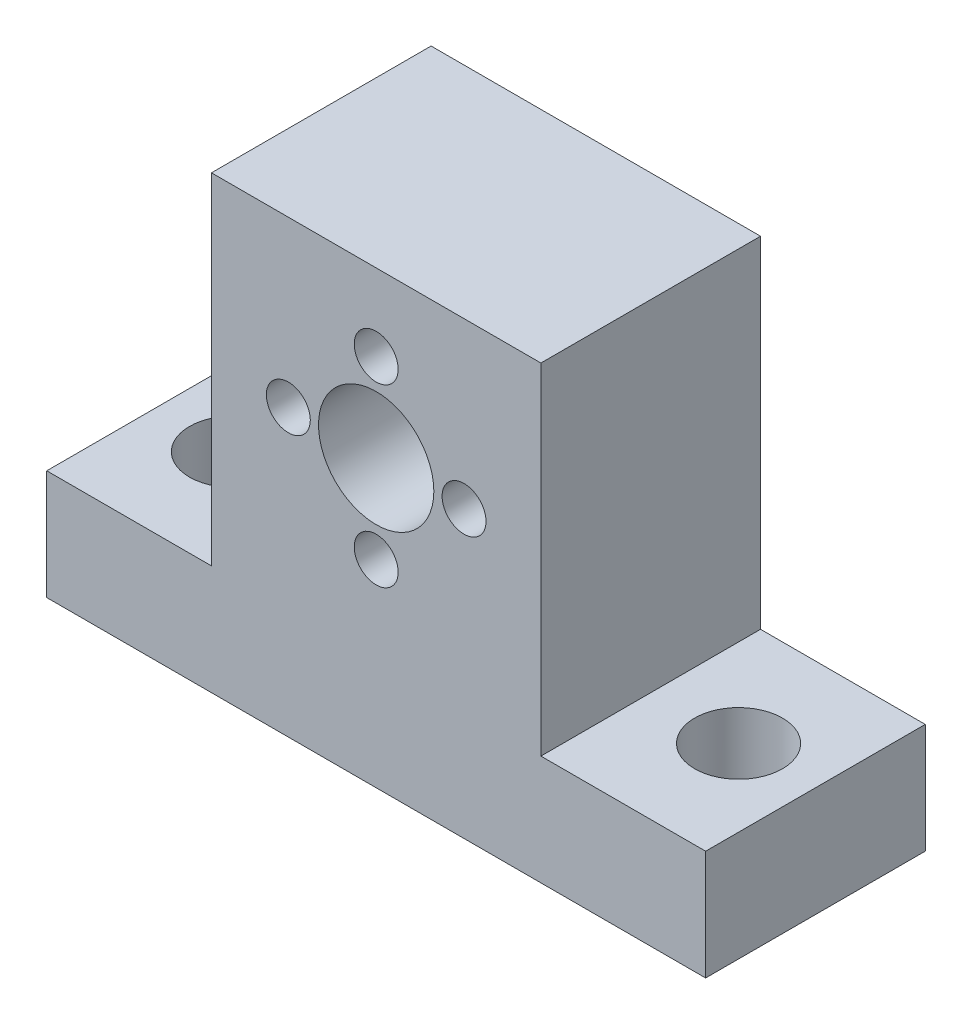
ISO-10303-21;
HEADER;
FILE_DESCRIPTION(('STEP AP214'),'2;1');
FILE_NAME('part.step','',(''),(''),'','','');
FILE_SCHEMA(('AUTOMOTIVE_DESIGN { 1 0 10303 214 1 1 1 1 }'));
ENDSEC;
DATA;
#1=APPLICATION_CONTEXT('core data for automotive mechanical design processes');
#2=APPLICATION_PROTOCOL_DEFINITION('international standard','automotive_design',2000,#1);
#3=PRODUCT_CONTEXT('',#1,'mechanical');
#4=PRODUCT('Part','Part','',(#3));
#5=PRODUCT_RELATED_PRODUCT_CATEGORY('part','',(#4));
#6=PRODUCT_DEFINITION_FORMATION('','',#4);
#7=PRODUCT_DEFINITION_CONTEXT('part definition',#1,'design');
#8=PRODUCT_DEFINITION('design','',#6,#7);
#9=PRODUCT_DEFINITION_SHAPE('','',#8);
#10=(LENGTH_UNIT() NAMED_UNIT(*) SI_UNIT(.MILLI.,.METRE.));
#11=(NAMED_UNIT(*) PLANE_ANGLE_UNIT() SI_UNIT($,.RADIAN.));
#12=(NAMED_UNIT(*) SI_UNIT($,.STERADIAN.) SOLID_ANGLE_UNIT());
#13=UNCERTAINTY_MEASURE_WITH_UNIT(LENGTH_MEASURE(1.E-05),#10,'distance_accuracy_value','');
#14=(GEOMETRIC_REPRESENTATION_CONTEXT(3) GLOBAL_UNCERTAINTY_ASSIGNED_CONTEXT((#13)) GLOBAL_UNIT_ASSIGNED_CONTEXT((#10,
#11,#12)) REPRESENTATION_CONTEXT('',''));
#15=CARTESIAN_POINT('',(0.,0.,0.));
#16=DIRECTION('',(0.,0.,1.));
#17=DIRECTION('',(1.,0.,0.));
#18=AXIS2_PLACEMENT_3D('',#15,#16,#17);
#19=CARTESIAN_POINT('',(0.,0.,20.));
#20=DIRECTION('',(0.,0.,-1.));
#21=DIRECTION('',(-1.,0.,0.));
#22=AXIS2_PLACEMENT_3D('',#19,#20,#21);
#23=PLANE('',#22);
#24=CARTESIAN_POINT('',(-8.,0.,20.));
#25=DIRECTION('',(0.,0.,1.));
#26=DIRECTION('',(1.,0.,0.));
#27=AXIS2_PLACEMENT_3D('',#24,#25,#26);
#28=CIRCLE('',#27,2.);
#29=CARTESIAN_POINT('',(-6.,0.,20.));
#30=VERTEX_POINT('',#29);
#31=EDGE_CURVE('E173',#30,#30,#28,.T.);
#32=ORIENTED_EDGE('',*,*,#31,.F.);
#33=EDGE_LOOP('',(#32));
#34=FACE_BOUND('',#33,.T.);
#35=CARTESIAN_POINT('',(0.,-8.,20.));
#36=DIRECTION('',(0.,0.,1.));
#37=DIRECTION('',(1.,0.,0.));
#38=AXIS2_PLACEMENT_3D('',#35,#36,#37);
#39=CIRCLE('',#38,2.);
#40=CARTESIAN_POINT('',(1.99999999999994,-8.,20.));
#41=VERTEX_POINT('',#40);
#42=EDGE_CURVE('E179',#41,#41,#39,.T.);
#43=ORIENTED_EDGE('',*,*,#42,.F.);
#44=EDGE_LOOP('',(#43));
#45=FACE_BOUND('',#44,.T.);
#46=CARTESIAN_POINT('',(8.,0.,20.));
#47=DIRECTION('',(0.,0.,1.));
#48=DIRECTION('',(1.,0.,0.));
#49=AXIS2_PLACEMENT_3D('',#46,#47,#48);
#50=CIRCLE('',#49,2.);
#51=CARTESIAN_POINT('',(10.,0.,20.));
#52=VERTEX_POINT('',#51);
#53=EDGE_CURVE('E185',#52,#52,#50,.T.);
#54=ORIENTED_EDGE('',*,*,#53,.F.);
#55=EDGE_LOOP('',(#54));
#56=FACE_BOUND('',#55,.T.);
#57=CARTESIAN_POINT('',(0.,8.,20.));
#58=DIRECTION('',(0.,0.,1.));
#59=DIRECTION('',(1.,0.,0.));
#60=AXIS2_PLACEMENT_3D('',#57,#58,#59);
#61=CIRCLE('',#60,2.);
#62=CARTESIAN_POINT('',(2.,8.,20.));
#63=VERTEX_POINT('',#62);
#64=EDGE_CURVE('E191',#63,#63,#61,.T.);
#65=ORIENTED_EDGE('',*,*,#64,.F.);
#66=EDGE_LOOP('',(#65));
#67=FACE_BOUND('',#66,.T.);
#68=CARTESIAN_POINT('',(0.,0.,20.));
#69=DIRECTION('',(0.,0.,1.));
#70=DIRECTION('',(1.,0.,0.));
#71=AXIS2_PLACEMENT_3D('',#68,#69,#70);
#72=CIRCLE('',#71,5.25);
#73=CARTESIAN_POINT('',(5.25,0.,20.));
#74=VERTEX_POINT('',#73);
#75=EDGE_CURVE('E132',#74,#74,#72,.T.);
#76=ORIENTED_EDGE('',*,*,#75,.F.);
#77=EDGE_LOOP('',(#76));
#78=FACE_BOUND('',#77,.T.);
#79=DIRECTION('',(1.,0.,0.));
#80=VECTOR('',#79,1.);
#81=CARTESIAN_POINT('',(0.,-16.,20.));
#82=LINE('',#81,#80);
#83=CARTESIAN_POINT('',(-29.9999999999634,-16.,20.));
#84=VERTEX_POINT('',#83);
#85=CARTESIAN_POINT('',(-15.,-16.,20.));
#86=VERTEX_POINT('',#85);
#87=EDGE_CURVE('E103',#84,#86,#82,.T.);
#88=ORIENTED_EDGE('',*,*,#87,.F.);
#89=DIRECTION('',(0.,-1.,0.));
#90=VECTOR('',#89,1.);
#91=CARTESIAN_POINT('',(-29.9999999999634,-26.,20.));
#92=LINE('',#91,#90);
#93=CARTESIAN_POINT('',(-29.9999999999634,-26.,20.));
#94=VERTEX_POINT('',#93);
#95=EDGE_CURVE('E113',#84,#94,#92,.T.);
#96=ORIENTED_EDGE('',*,*,#95,.T.);
#97=DIRECTION('',(1.,0.,0.));
#98=VECTOR('',#97,1.);
#99=CARTESIAN_POINT('',(-29.9999999999634,-26.,20.));
#100=LINE('',#99,#98);
#101=CARTESIAN_POINT('',(30.0000000000366,-26.,20.));
#102=VERTEX_POINT('',#101);
#103=EDGE_CURVE('E120',#94,#102,#100,.T.);
#104=ORIENTED_EDGE('',*,*,#103,.T.);
#105=DIRECTION('',(0.,1.,0.));
#106=VECTOR('',#105,1.);
#107=CARTESIAN_POINT('',(30.0000000000366,-26.,20.));
#108=LINE('',#107,#106);
#109=CARTESIAN_POINT('',(30.0000000000366,-16.,20.));
#110=VERTEX_POINT('',#109);
#111=EDGE_CURVE('E124',#102,#110,#108,.T.);
#112=ORIENTED_EDGE('',*,*,#111,.T.);
#113=DIRECTION('',(-1.,0.,0.));
#114=VECTOR('',#113,1.);
#115=CARTESIAN_POINT('',(0.,-16.,20.));
#116=LINE('',#115,#114);
#117=CARTESIAN_POINT('',(15.,-16.,20.));
#118=VERTEX_POINT('',#117);
#119=EDGE_CURVE('E151',#110,#118,#116,.T.);
#120=ORIENTED_EDGE('',*,*,#119,.T.);
#121=DIRECTION('',(0.,1.,0.));
#122=VECTOR('',#121,1.);
#123=CARTESIAN_POINT('',(15.,0.,20.));
#124=LINE('',#123,#122);
#125=CARTESIAN_POINT('',(15.,15.,20.));
#126=VERTEX_POINT('',#125);
#127=EDGE_CURVE('E154',#118,#126,#124,.T.);
#128=ORIENTED_EDGE('',*,*,#127,.T.);
#129=DIRECTION('',(-1.,0.,0.));
#130=VECTOR('',#129,1.);
#131=CARTESIAN_POINT('',(-29.9999999999634,15.,20.));
#132=LINE('',#131,#130);
#133=CARTESIAN_POINT('',(-15.,15.,20.));
#134=VERTEX_POINT('',#133);
#135=EDGE_CURVE('E121',#126,#134,#132,.T.);
#136=ORIENTED_EDGE('',*,*,#135,.T.);
#137=DIRECTION('',(0.,1.,0.));
#138=VECTOR('',#137,1.);
#139=CARTESIAN_POINT('',(-15.,0.,20.));
#140=LINE('',#139,#138);
#141=EDGE_CURVE('E109',#86,#134,#140,.T.);
#142=ORIENTED_EDGE('',*,*,#141,.F.);
#143=EDGE_LOOP('',(#88,#96,#104,#112,#120,#128,#136,#142));
#144=FACE_BOUND('',#143,.T.);
#145=ADVANCED_FACE('F34',(#34,#45,#56,#67,#78,#144),#23,.F.);
#146=CARTESIAN_POINT('',(0.,0.,0.));
#147=DIRECTION('',(0.,0.,-1.));
#148=DIRECTION('',(-1.,0.,0.));
#149=AXIS2_PLACEMENT_3D('',#146,#147,#148);
#150=PLANE('',#149);
#151=CARTESIAN_POINT('',(0.,-8.,0.));
#152=DIRECTION('',(0.,0.,1.));
#153=DIRECTION('',(1.,0.,0.));
#154=AXIS2_PLACEMENT_3D('',#151,#152,#153);
#155=CIRCLE('',#154,2.);
#156=CARTESIAN_POINT('',(1.99999999999994,-8.,0.));
#157=VERTEX_POINT('',#156);
#158=EDGE_CURVE('E176',#157,#157,#155,.T.);
#159=ORIENTED_EDGE('',*,*,#158,.T.);
#160=EDGE_LOOP('',(#159));
#161=FACE_BOUND('',#160,.T.);
#162=CARTESIAN_POINT('',(0.,8.,0.));
#163=DIRECTION('',(0.,0.,1.));
#164=DIRECTION('',(1.,0.,0.));
#165=AXIS2_PLACEMENT_3D('',#162,#163,#164);
#166=CIRCLE('',#165,2.);
#167=CARTESIAN_POINT('',(2.,8.,0.));
#168=VERTEX_POINT('',#167);
#169=EDGE_CURVE('E188',#168,#168,#166,.T.);
#170=ORIENTED_EDGE('',*,*,#169,.T.);
#171=EDGE_LOOP('',(#170));
#172=FACE_BOUND('',#171,.T.);
#173=CARTESIAN_POINT('',(0.,0.,0.));
#174=DIRECTION('',(0.,0.,1.));
#175=DIRECTION('',(1.,0.,0.));
#176=AXIS2_PLACEMENT_3D('',#173,#174,#175);
#177=CIRCLE('',#176,5.25);
#178=CARTESIAN_POINT('',(5.25,0.,0.));
#179=VERTEX_POINT('',#178);
#180=EDGE_CURVE('E194',#179,#179,#177,.T.);
#181=ORIENTED_EDGE('',*,*,#180,.T.);
#182=EDGE_LOOP('',(#181));
#183=FACE_BOUND('',#182,.T.);
#184=CARTESIAN_POINT('',(8.,0.,0.));
#185=DIRECTION('',(0.,0.,1.));
#186=DIRECTION('',(1.,0.,0.));
#187=AXIS2_PLACEMENT_3D('',#184,#185,#186);
#188=CIRCLE('',#187,2.);
#189=CARTESIAN_POINT('',(10.,0.,0.));
#190=VERTEX_POINT('',#189);
#191=EDGE_CURVE('E182',#190,#190,#188,.T.);
#192=ORIENTED_EDGE('',*,*,#191,.T.);
#193=EDGE_LOOP('',(#192));
#194=FACE_BOUND('',#193,.T.);
#195=CARTESIAN_POINT('',(-8.,0.,0.));
#196=DIRECTION('',(0.,0.,1.));
#197=DIRECTION('',(1.,0.,0.));
#198=AXIS2_PLACEMENT_3D('',#195,#196,#197);
#199=CIRCLE('',#198,2.);
#200=CARTESIAN_POINT('',(-6.,0.,0.));
#201=VERTEX_POINT('',#200);
#202=EDGE_CURVE('E170',#201,#201,#199,.T.);
#203=ORIENTED_EDGE('',*,*,#202,.T.);
#204=EDGE_LOOP('',(#203));
#205=FACE_BOUND('',#204,.T.);
#206=DIRECTION('',(0.,-1.,0.));
#207=VECTOR('',#206,1.);
#208=CARTESIAN_POINT('',(-29.9999999999634,-26.,0.));
#209=LINE('',#208,#207);
#210=CARTESIAN_POINT('',(-29.9999999999634,-16.,0.));
#211=VERTEX_POINT('',#210);
#212=CARTESIAN_POINT('',(-29.9999999999634,-26.,0.));
#213=VERTEX_POINT('',#212);
#214=EDGE_CURVE('E135',#211,#213,#209,.T.);
#215=ORIENTED_EDGE('',*,*,#214,.F.);
#216=DIRECTION('',(1.,0.,0.));
#217=VECTOR('',#216,1.);
#218=CARTESIAN_POINT('',(0.,-16.,0.));
#219=LINE('',#218,#217);
#220=CARTESIAN_POINT('',(-15.,-16.,0.));
#221=VERTEX_POINT('',#220);
#222=EDGE_CURVE('E59',#211,#221,#219,.T.);
#223=ORIENTED_EDGE('',*,*,#222,.T.);
#224=DIRECTION('',(0.,1.,0.));
#225=VECTOR('',#224,1.);
#226=CARTESIAN_POINT('',(-15.,0.,0.));
#227=LINE('',#226,#225);
#228=CARTESIAN_POINT('',(-15.,15.,0.));
#229=VERTEX_POINT('',#228);
#230=EDGE_CURVE('E116',#221,#229,#227,.T.);
#231=ORIENTED_EDGE('',*,*,#230,.T.);
#232=DIRECTION('',(-1.,0.,0.));
#233=VECTOR('',#232,1.);
#234=CARTESIAN_POINT('',(-29.9999999999634,15.,0.));
#235=LINE('',#234,#233);
#236=CARTESIAN_POINT('',(15.,15.,0.));
#237=VERTEX_POINT('',#236);
#238=EDGE_CURVE('E131',#237,#229,#235,.T.);
#239=ORIENTED_EDGE('',*,*,#238,.F.);
#240=DIRECTION('',(0.,1.,0.));
#241=VECTOR('',#240,1.);
#242=CARTESIAN_POINT('',(15.,0.,0.));
#243=LINE('',#242,#241);
#244=CARTESIAN_POINT('',(15.,-16.,0.));
#245=VERTEX_POINT('',#244);
#246=EDGE_CURVE('E51',#245,#237,#243,.T.);
#247=ORIENTED_EDGE('',*,*,#246,.F.);
#248=DIRECTION('',(-1.,0.,0.));
#249=VECTOR('',#248,1.);
#250=CARTESIAN_POINT('',(0.,-16.,0.));
#251=LINE('',#250,#249);
#252=CARTESIAN_POINT('',(30.0000000000366,-16.,0.));
#253=VERTEX_POINT('',#252);
#254=EDGE_CURVE('E158',#253,#245,#251,.T.);
#255=ORIENTED_EDGE('',*,*,#254,.F.);
#256=DIRECTION('',(0.,1.,0.));
#257=VECTOR('',#256,1.);
#258=CARTESIAN_POINT('',(30.0000000000366,-26.,0.));
#259=LINE('',#258,#257);
#260=CARTESIAN_POINT('',(30.0000000000366,-26.,0.));
#261=VERTEX_POINT('',#260);
#262=EDGE_CURVE('E128',#261,#253,#259,.T.);
#263=ORIENTED_EDGE('',*,*,#262,.F.);
#264=DIRECTION('',(1.,0.,0.));
#265=VECTOR('',#264,1.);
#266=CARTESIAN_POINT('',(-29.9999999999634,-26.,0.));
#267=LINE('',#266,#265);
#268=EDGE_CURVE('E137',#213,#261,#267,.T.);
#269=ORIENTED_EDGE('',*,*,#268,.F.);
#270=EDGE_LOOP('',(#215,#223,#231,#239,#247,#255,#263,#269));
#271=FACE_BOUND('',#270,.T.);
#272=ADVANCED_FACE('F211',(#161,#172,#183,#194,#205,#271),#150,.T.);
#273=CARTESIAN_POINT('',(-29.9999999999634,15.,20.));
#274=DIRECTION('',(0.,-1.,0.));
#275=DIRECTION('',(1.,0.,0.));
#276=AXIS2_PLACEMENT_3D('',#273,#274,#275);
#277=PLANE('',#276);
#278=DIRECTION('',(0.,0.,-1.));
#279=VECTOR('',#278,1.);
#280=CARTESIAN_POINT('',(-15.,15.,20.));
#281=LINE('',#280,#279);
#282=EDGE_CURVE('E108',#134,#229,#281,.T.);
#283=ORIENTED_EDGE('',*,*,#282,.F.);
#284=ORIENTED_EDGE('',*,*,#135,.F.);
#285=DIRECTION('',(0.,0.,-1.));
#286=VECTOR('',#285,1.);
#287=CARTESIAN_POINT('',(15.,15.,20.));
#288=LINE('',#287,#286);
#289=EDGE_CURVE('E164',#126,#237,#288,.T.);
#290=ORIENTED_EDGE('',*,*,#289,.T.);
#291=ORIENTED_EDGE('',*,*,#238,.T.);
#292=EDGE_LOOP('',(#283,#284,#290,#291));
#293=FACE_BOUND('',#292,.T.);
#294=ADVANCED_FACE('F217',(#293),#277,.F.);
#295=CARTESIAN_POINT('',(-29.9999999999634,-26.,20.));
#296=DIRECTION('',(1.,0.,0.));
#297=DIRECTION('',(0.,0.,-1.));
#298=AXIS2_PLACEMENT_3D('',#295,#296,#297);
#299=PLANE('',#298);
#300=DIRECTION('',(0.,0.,-1.));
#301=VECTOR('',#300,1.);
#302=CARTESIAN_POINT('',(-29.9999999999634,-16.,20.));
#303=LINE('',#302,#301);
#304=EDGE_CURVE('E99',#84,#211,#303,.T.);
#305=ORIENTED_EDGE('',*,*,#304,.T.);
#306=ORIENTED_EDGE('',*,*,#214,.T.);
#307=DIRECTION('',(0.,0.,-1.));
#308=VECTOR('',#307,1.);
#309=CARTESIAN_POINT('',(-29.9999999999634,-26.,20.));
#310=LINE('',#309,#308);
#311=EDGE_CURVE('E11',#94,#213,#310,.T.);
#312=ORIENTED_EDGE('',*,*,#311,.F.);
#313=ORIENTED_EDGE('',*,*,#95,.F.);
#314=EDGE_LOOP('',(#305,#306,#312,#313));
#315=FACE_BOUND('',#314,.T.);
#316=ADVANCED_FACE('F118',(#315),#299,.F.);
#317=CARTESIAN_POINT('',(-22.9999999999634,-26.,10.));
#318=DIRECTION('',(0.,1.,0.));
#319=DIRECTION('',(0.,0.,1.));
#320=AXIS2_PLACEMENT_3D('',#317,#318,#319);
#321=CYLINDRICAL_SURFACE('',#320,4.);
#322=CARTESIAN_POINT('',(-22.9999999999634,-26.,10.));
#323=DIRECTION('',(0.,1.,0.));
#324=DIRECTION('',(0.,0.,1.));
#325=AXIS2_PLACEMENT_3D('',#322,#323,#324);
#326=CIRCLE('',#325,4.);
#327=CARTESIAN_POINT('',(-22.9999999999634,-26.,14.));
#328=VERTEX_POINT('',#327);
#329=EDGE_CURVE('E167',#328,#328,#326,.T.);
#330=ORIENTED_EDGE('',*,*,#329,.F.);
#331=EDGE_LOOP('',(#330));
#332=FACE_BOUND('',#331,.T.);
#333=CARTESIAN_POINT('',(-22.9999999999634,-16.,10.));
#334=DIRECTION('',(0.,1.,0.));
#335=DIRECTION('',(-1.,0.,0.));
#336=AXIS2_PLACEMENT_3D('',#333,#334,#335);
#337=CIRCLE('',#336,4.);
#338=CARTESIAN_POINT('',(-26.9999999999634,-16.,10.));
#339=VERTEX_POINT('',#338);
#340=EDGE_CURVE('E140',#339,#339,#337,.F.);
#341=ORIENTED_EDGE('',*,*,#340,.F.);
#342=EDGE_LOOP('',(#341));
#343=FACE_BOUND('',#342,.T.);
#344=ADVANCED_FACE('F248',(#332,#343),#321,.F.);
#345=CARTESIAN_POINT('',(30.0000000000366,-26.,20.));
#346=DIRECTION('',(-1.,0.,0.));
#347=DIRECTION('',(0.,0.,1.));
#348=AXIS2_PLACEMENT_3D('',#345,#346,#347);
#349=PLANE('',#348);
#350=ORIENTED_EDGE('',*,*,#262,.T.);
#351=DIRECTION('',(0.,0.,-1.));
#352=VECTOR('',#351,1.);
#353=CARTESIAN_POINT('',(30.0000000000366,-16.,20.));
#354=LINE('',#353,#352);
#355=EDGE_CURVE('E162',#110,#253,#354,.T.);
#356=ORIENTED_EDGE('',*,*,#355,.F.);
#357=ORIENTED_EDGE('',*,*,#111,.F.);
#358=DIRECTION('',(0.,0.,-1.));
#359=VECTOR('',#358,1.);
#360=CARTESIAN_POINT('',(30.0000000000366,-26.,20.));
#361=LINE('',#360,#359);
#362=EDGE_CURVE('E43',#102,#261,#361,.T.);
#363=ORIENTED_EDGE('',*,*,#362,.T.);
#364=EDGE_LOOP('',(#350,#356,#357,#363));
#365=FACE_BOUND('',#364,.T.);
#366=ADVANCED_FACE('F36',(#365),#349,.F.);
#367=CARTESIAN_POINT('',(-29.9999999999634,-26.,20.));
#368=DIRECTION('',(0.,1.,0.));
#369=DIRECTION('',(-1.,0.,0.));
#370=AXIS2_PLACEMENT_3D('',#367,#368,#369);
#371=PLANE('',#370);
#372=ORIENTED_EDGE('',*,*,#329,.T.);
#373=EDGE_LOOP('',(#372));
#374=FACE_BOUND('',#373,.T.);
#375=CARTESIAN_POINT('',(22.9999999999634,-26.,10.));
#376=DIRECTION('',(0.,1.,0.));
#377=DIRECTION('',(0.,0.,-1.));
#378=AXIS2_PLACEMENT_3D('',#375,#376,#377);
#379=CIRCLE('',#378,4.);
#380=CARTESIAN_POINT('',(22.9999999999634,-26.,6.));
#381=VERTEX_POINT('',#380);
#382=EDGE_CURVE('E145',#381,#381,#379,.T.);
#383=ORIENTED_EDGE('',*,*,#382,.T.);
#384=EDGE_LOOP('',(#383));
#385=FACE_BOUND('',#384,.T.);
#386=ORIENTED_EDGE('',*,*,#268,.T.);
#387=ORIENTED_EDGE('',*,*,#362,.F.);
#388=ORIENTED_EDGE('',*,*,#103,.F.);
#389=ORIENTED_EDGE('',*,*,#311,.T.);
#390=EDGE_LOOP('',(#386,#387,#388,#389));
#391=FACE_BOUND('',#390,.T.);
#392=ADVANCED_FACE('F243',(#374,#385,#391),#371,.F.);
#393=CARTESIAN_POINT('',(0.,0.,20.));
#394=DIRECTION('',(0.,0.,-1.));
#395=DIRECTION('',(-1.,0.,0.));
#396=AXIS2_PLACEMENT_3D('',#393,#394,#395);
#397=CYLINDRICAL_SURFACE('',#396,5.25);
#398=ORIENTED_EDGE('',*,*,#75,.T.);
#399=EDGE_LOOP('',(#398));
#400=FACE_BOUND('',#399,.T.);
#401=ORIENTED_EDGE('',*,*,#180,.F.);
#402=EDGE_LOOP('',(#401));
#403=FACE_BOUND('',#402,.T.);
#404=ADVANCED_FACE('F240',(#400,#403),#397,.F.);
#405=CARTESIAN_POINT('',(0.,8.,20.));
#406=DIRECTION('',(0.,0.,-1.));
#407=DIRECTION('',(-1.,0.,0.));
#408=AXIS2_PLACEMENT_3D('',#405,#406,#407);
#409=CYLINDRICAL_SURFACE('',#408,2.);
#410=ORIENTED_EDGE('',*,*,#64,.T.);
#411=EDGE_LOOP('',(#410));
#412=FACE_BOUND('',#411,.T.);
#413=ORIENTED_EDGE('',*,*,#169,.F.);
#414=EDGE_LOOP('',(#413));
#415=FACE_BOUND('',#414,.T.);
#416=ADVANCED_FACE('F282',(#412,#415),#409,.F.);
#417=CARTESIAN_POINT('',(8.,0.,20.));
#418=DIRECTION('',(0.,0.,-1.));
#419=DIRECTION('',(-1.,0.,0.));
#420=AXIS2_PLACEMENT_3D('',#417,#418,#419);
#421=CYLINDRICAL_SURFACE('',#420,2.);
#422=ORIENTED_EDGE('',*,*,#53,.T.);
#423=EDGE_LOOP('',(#422));
#424=FACE_BOUND('',#423,.T.);
#425=ORIENTED_EDGE('',*,*,#191,.F.);
#426=EDGE_LOOP('',(#425));
#427=FACE_BOUND('',#426,.T.);
#428=ADVANCED_FACE('F289',(#424,#427),#421,.F.);
#429=CARTESIAN_POINT('',(0.,-8.,20.));
#430=DIRECTION('',(0.,0.,-1.));
#431=DIRECTION('',(-1.,0.,0.));
#432=AXIS2_PLACEMENT_3D('',#429,#430,#431);
#433=CYLINDRICAL_SURFACE('',#432,2.);
#434=ORIENTED_EDGE('',*,*,#42,.T.);
#435=EDGE_LOOP('',(#434));
#436=FACE_BOUND('',#435,.T.);
#437=ORIENTED_EDGE('',*,*,#158,.F.);
#438=EDGE_LOOP('',(#437));
#439=FACE_BOUND('',#438,.T.);
#440=ADVANCED_FACE('F296',(#436,#439),#433,.F.);
#441=CARTESIAN_POINT('',(-8.,0.,20.));
#442=DIRECTION('',(0.,0.,-1.));
#443=DIRECTION('',(-1.,0.,0.));
#444=AXIS2_PLACEMENT_3D('',#441,#442,#443);
#445=CYLINDRICAL_SURFACE('',#444,2.);
#446=ORIENTED_EDGE('',*,*,#31,.T.);
#447=EDGE_LOOP('',(#446));
#448=FACE_BOUND('',#447,.T.);
#449=ORIENTED_EDGE('',*,*,#202,.F.);
#450=EDGE_LOOP('',(#449));
#451=FACE_BOUND('',#450,.T.);
#452=ADVANCED_FACE('F304',(#448,#451),#445,.F.);
#453=CARTESIAN_POINT('',(22.9999999999634,-26.,10.));
#454=DIRECTION('',(0.,1.,0.));
#455=DIRECTION('',(0.,0.,1.));
#456=AXIS2_PLACEMENT_3D('',#453,#454,#455);
#457=CYLINDRICAL_SURFACE('',#456,4.);
#458=CARTESIAN_POINT('',(22.9999999999634,-16.,10.));
#459=DIRECTION('',(0.,-1.,0.));
#460=DIRECTION('',(1.,0.,0.));
#461=AXIS2_PLACEMENT_3D('',#458,#459,#460);
#462=CIRCLE('',#461,4.);
#463=CARTESIAN_POINT('',(26.9999999999634,-16.,10.));
#464=VERTEX_POINT('',#463);
#465=EDGE_CURVE('E38',#464,#464,#462,.F.);
#466=ORIENTED_EDGE('',*,*,#465,.T.);
#467=EDGE_LOOP('',(#466));
#468=FACE_BOUND('',#467,.T.);
#469=ORIENTED_EDGE('',*,*,#382,.F.);
#470=EDGE_LOOP('',(#469));
#471=FACE_BOUND('',#470,.T.);
#472=ADVANCED_FACE('F311',(#468,#471),#457,.F.);
#473=CARTESIAN_POINT('',(0.,-16.,20.));
#474=DIRECTION('',(0.,1.,0.));
#475=DIRECTION('',(-1.,0.,0.));
#476=AXIS2_PLACEMENT_3D('',#473,#474,#475);
#477=PLANE('',#476);
#478=ORIENTED_EDGE('',*,*,#222,.F.);
#479=ORIENTED_EDGE('',*,*,#304,.F.);
#480=ORIENTED_EDGE('',*,*,#87,.T.);
#481=DIRECTION('',(0.,0.,-1.));
#482=VECTOR('',#481,1.);
#483=CARTESIAN_POINT('',(-15.,-16.,20.));
#484=LINE('',#483,#482);
#485=EDGE_CURVE('E142',#86,#221,#484,.T.);
#486=ORIENTED_EDGE('',*,*,#485,.T.);
#487=EDGE_LOOP('',(#478,#479,#480,#486));
#488=FACE_BOUND('',#487,.T.);
#489=ORIENTED_EDGE('',*,*,#340,.T.);
#490=EDGE_LOOP('',(#489));
#491=FACE_BOUND('',#490,.T.);
#492=ADVANCED_FACE('F101',(#488,#491),#477,.T.);
#493=CARTESIAN_POINT('',(-15.,0.,20.));
#494=DIRECTION('',(-1.,0.,0.));
#495=DIRECTION('',(0.,0.,1.));
#496=AXIS2_PLACEMENT_3D('',#493,#494,#495);
#497=PLANE('',#496);
#498=ORIENTED_EDGE('',*,*,#230,.F.);
#499=ORIENTED_EDGE('',*,*,#485,.F.);
#500=ORIENTED_EDGE('',*,*,#141,.T.);
#501=ORIENTED_EDGE('',*,*,#282,.T.);
#502=EDGE_LOOP('',(#498,#499,#500,#501));
#503=FACE_BOUND('',#502,.T.);
#504=ADVANCED_FACE('F226',(#503),#497,.T.);
#505=CARTESIAN_POINT('',(0.,-16.,20.));
#506=DIRECTION('',(0.,-1.,0.));
#507=DIRECTION('',(1.,0.,0.));
#508=AXIS2_PLACEMENT_3D('',#505,#506,#507);
#509=PLANE('',#508);
#510=ORIENTED_EDGE('',*,*,#254,.T.);
#511=DIRECTION('',(0.,0.,-1.));
#512=VECTOR('',#511,1.);
#513=CARTESIAN_POINT('',(15.,-16.,20.));
#514=LINE('',#513,#512);
#515=EDGE_CURVE('E157',#118,#245,#514,.T.);
#516=ORIENTED_EDGE('',*,*,#515,.F.);
#517=ORIENTED_EDGE('',*,*,#119,.F.);
#518=ORIENTED_EDGE('',*,*,#355,.T.);
#519=EDGE_LOOP('',(#510,#516,#517,#518));
#520=FACE_BOUND('',#519,.T.);
#521=ORIENTED_EDGE('',*,*,#465,.F.);
#522=EDGE_LOOP('',(#521));
#523=FACE_BOUND('',#522,.T.);
#524=ADVANCED_FACE('F208',(#520,#523),#509,.F.);
#525=CARTESIAN_POINT('',(15.,0.,20.));
#526=DIRECTION('',(-1.,0.,0.));
#527=DIRECTION('',(0.,0.,1.));
#528=AXIS2_PLACEMENT_3D('',#525,#526,#527);
#529=PLANE('',#528);
#530=ORIENTED_EDGE('',*,*,#246,.T.);
#531=ORIENTED_EDGE('',*,*,#289,.F.);
#532=ORIENTED_EDGE('',*,*,#127,.F.);
#533=ORIENTED_EDGE('',*,*,#515,.T.);
#534=EDGE_LOOP('',(#530,#531,#532,#533));
#535=FACE_BOUND('',#534,.T.);
#536=ADVANCED_FACE('F220',(#535),#529,.F.);
#537=CLOSED_SHELL('',(#145,#272,#294,#316,#344,#366,#392,#404,#416,#428,#440,#452,#472,#492,
#504,#524,#536));
#538=MANIFOLD_SOLID_BREP('B2',#537);
#539=ADVANCED_BREP_SHAPE_REPRESENTATION('',(#18,#538),#14);
#540=SHAPE_DEFINITION_REPRESENTATION(#9,#539);
ENDSEC;
END-ISO-10303-21;
